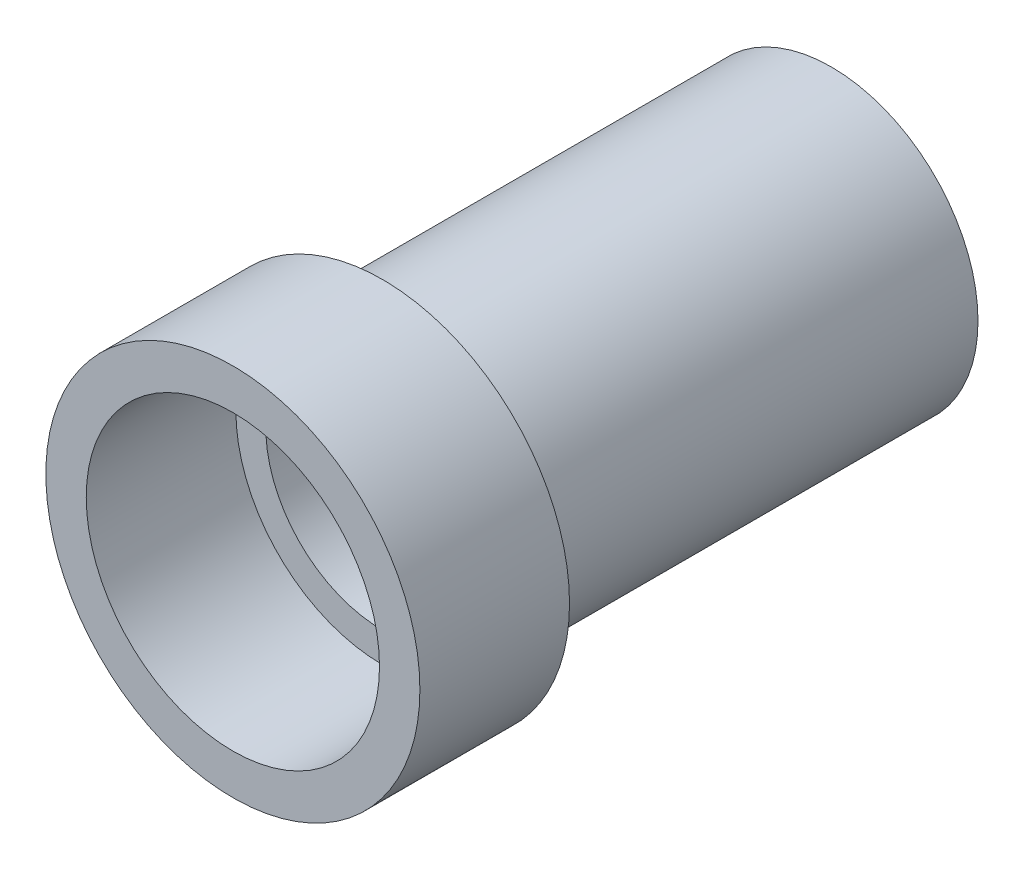
ISO-10303-21;
HEADER;
FILE_DESCRIPTION(('STEP AP214'),'2;1');
FILE_NAME('part.step','',(''),(''),'','','');
FILE_SCHEMA(('AUTOMOTIVE_DESIGN { 1 0 10303 214 1 1 1 1 }'));
ENDSEC;
DATA;
#1=APPLICATION_CONTEXT('core data for automotive mechanical design processes');
#2=APPLICATION_PROTOCOL_DEFINITION('international standard','automotive_design',2000,#1);
#3=PRODUCT_CONTEXT('',#1,'mechanical');
#4=PRODUCT('Part','Part','',(#3));
#5=PRODUCT_RELATED_PRODUCT_CATEGORY('part','',(#4));
#6=PRODUCT_DEFINITION_FORMATION('','',#4);
#7=PRODUCT_DEFINITION_CONTEXT('part definition',#1,'design');
#8=PRODUCT_DEFINITION('design','',#6,#7);
#9=PRODUCT_DEFINITION_SHAPE('','',#8);
#10=(LENGTH_UNIT() NAMED_UNIT(*) SI_UNIT(.MILLI.,.METRE.));
#11=(NAMED_UNIT(*) PLANE_ANGLE_UNIT() SI_UNIT($,.RADIAN.));
#12=(NAMED_UNIT(*) SI_UNIT($,.STERADIAN.) SOLID_ANGLE_UNIT());
#13=UNCERTAINTY_MEASURE_WITH_UNIT(LENGTH_MEASURE(1.E-05),#10,'distance_accuracy_value','');
#14=(GEOMETRIC_REPRESENTATION_CONTEXT(3) GLOBAL_UNCERTAINTY_ASSIGNED_CONTEXT((#13)) GLOBAL_UNIT_ASSIGNED_CONTEXT((#10,
#11,#12)) REPRESENTATION_CONTEXT('',''));
#15=CARTESIAN_POINT('',(0.,0.,0.));
#16=DIRECTION('',(0.,0.,1.));
#17=DIRECTION('',(1.,0.,0.));
#18=AXIS2_PLACEMENT_3D('',#15,#16,#17);
#19=CARTESIAN_POINT('',(0.,142.24,12.7));
#20=DIRECTION('',(0.,0.,1.));
#21=DIRECTION('',(1.,0.,0.));
#22=AXIS2_PLACEMENT_3D('',#19,#20,#21);
#23=PLANE('',#22);
#24=CARTESIAN_POINT('',(0.,142.24,12.7));
#25=DIRECTION('',(0.,0.,1.));
#26=DIRECTION('',(1.,0.,0.));
#27=AXIS2_PLACEMENT_3D('',#24,#25,#26);
#28=CIRCLE('',#27,15.875);
#29=CARTESIAN_POINT('',(15.875,142.24,12.7));
#30=VERTEX_POINT('',#29);
#31=EDGE_CURVE('E12',#30,#30,#28,.T.);
#32=ORIENTED_EDGE('',*,*,#31,.T.);
#33=EDGE_LOOP('',(#32));
#34=FACE_BOUND('',#33,.T.);
#35=CARTESIAN_POINT('',(0.,142.24,12.7));
#36=DIRECTION('',(0.,0.,1.));
#37=DIRECTION('',(1.,0.,0.));
#38=AXIS2_PLACEMENT_3D('',#35,#36,#37);
#39=CIRCLE('',#38,12.446);
#40=CARTESIAN_POINT('',(12.446,142.24,12.7));
#41=VERTEX_POINT('',#40);
#42=EDGE_CURVE('E55',#41,#41,#39,.T.);
#43=ORIENTED_EDGE('',*,*,#42,.F.);
#44=EDGE_LOOP('',(#43));
#45=FACE_BOUND('',#44,.T.);
#46=ADVANCED_FACE('F44',(#34,#45),#23,.T.);
#47=CARTESIAN_POINT('',(0.,142.24,0.));
#48=DIRECTION('',(0.,0.,1.));
#49=DIRECTION('',(1.,0.,0.));
#50=AXIS2_PLACEMENT_3D('',#47,#48,#49);
#51=PLANE('',#50);
#52=CARTESIAN_POINT('',(0.,142.24,0.));
#53=DIRECTION('',(0.,0.,1.));
#54=DIRECTION('',(1.,0.,0.));
#55=AXIS2_PLACEMENT_3D('',#52,#53,#54);
#56=CIRCLE('',#55,15.875);
#57=CARTESIAN_POINT('',(15.875,142.24,0.));
#58=VERTEX_POINT('',#57);
#59=EDGE_CURVE('E48',#58,#58,#56,.T.);
#60=ORIENTED_EDGE('',*,*,#59,.F.);
#61=EDGE_LOOP('',(#60));
#62=FACE_BOUND('',#61,.T.);
#63=CARTESIAN_POINT('',(0.,142.24,0.));
#64=DIRECTION('',(0.,0.,1.));
#65=DIRECTION('',(1.,0.,0.));
#66=AXIS2_PLACEMENT_3D('',#63,#64,#65);
#67=CIRCLE('',#66,12.446);
#68=CARTESIAN_POINT('',(12.446,142.24,0.));
#69=VERTEX_POINT('',#68);
#70=EDGE_CURVE('E57',#69,#69,#67,.T.);
#71=ORIENTED_EDGE('',*,*,#70,.T.);
#72=EDGE_LOOP('',(#71));
#73=FACE_BOUND('',#72,.T.);
#74=ADVANCED_FACE('F67',(#62,#73),#51,.F.);
#75=CARTESIAN_POINT('',(0.,142.24,12.7));
#76=DIRECTION('',(0.,0.,-1.));
#77=DIRECTION('',(-1.,0.,0.));
#78=AXIS2_PLACEMENT_3D('',#75,#76,#77);
#79=CYLINDRICAL_SURFACE('',#78,15.875);
#80=ORIENTED_EDGE('',*,*,#31,.F.);
#81=EDGE_LOOP('',(#80));
#82=FACE_BOUND('',#81,.T.);
#83=ORIENTED_EDGE('',*,*,#59,.T.);
#84=EDGE_LOOP('',(#83));
#85=FACE_BOUND('',#84,.T.);
#86=ADVANCED_FACE('F46',(#82,#85),#79,.T.);
#87=CARTESIAN_POINT('',(0.,142.24,12.7));
#88=DIRECTION('',(0.,0.,-1.));
#89=DIRECTION('',(-1.,0.,0.));
#90=AXIS2_PLACEMENT_3D('',#87,#88,#89);
#91=CYLINDRICAL_SURFACE('',#90,12.446);
#92=ORIENTED_EDGE('',*,*,#42,.T.);
#93=EDGE_LOOP('',(#92));
#94=FACE_BOUND('',#93,.T.);
#95=ORIENTED_EDGE('',*,*,#70,.F.);
#96=EDGE_LOOP('',(#95));
#97=FACE_BOUND('',#96,.T.);
#98=ADVANCED_FACE('F63',(#94,#97),#91,.F.);
#99=CLOSED_SHELL('',(#46,#74,#86,#98));
#100=MANIFOLD_SOLID_BREP('B2',#99);
#101=CARTESIAN_POINT('',(0.,142.24,-38.1));
#102=DIRECTION('',(0.,0.,1.));
#103=DIRECTION('',(1.,0.,0.));
#104=AXIS2_PLACEMENT_3D('',#101,#102,#103);
#105=CYLINDRICAL_SURFACE('',#104,12.446);
#106=CARTESIAN_POINT('',(0.,142.24,-38.1));
#107=DIRECTION('',(0.,0.,1.));
#108=DIRECTION('',(1.,0.,0.));
#109=AXIS2_PLACEMENT_3D('',#106,#107,#108);
#110=CIRCLE('',#109,12.446);
#111=CARTESIAN_POINT('',(12.446,142.24,-38.1));
#112=VERTEX_POINT('',#111);
#113=EDGE_CURVE('E43',#112,#112,#110,.T.);
#114=ORIENTED_EDGE('',*,*,#113,.T.);
#115=EDGE_LOOP('',(#114));
#116=FACE_BOUND('',#115,.T.);
#117=CARTESIAN_POINT('',(0.,142.24,0.));
#118=DIRECTION('',(0.,0.,1.));
#119=DIRECTION('',(1.,0.,0.));
#120=AXIS2_PLACEMENT_3D('',#117,#118,#119);
#121=CIRCLE('',#120,12.446);
#122=CARTESIAN_POINT('',(12.446,142.24,0.));
#123=VERTEX_POINT('',#122);
#124=EDGE_CURVE('E108',#123,#123,#121,.T.);
#125=ORIENTED_EDGE('',*,*,#124,.F.);
#126=EDGE_LOOP('',(#125));
#127=FACE_BOUND('',#126,.T.);
#128=ADVANCED_FACE('F105',(#116,#127),#105,.T.);
#129=CARTESIAN_POINT('',(0.,142.24,-38.1));
#130=DIRECTION('',(0.,0.,1.));
#131=DIRECTION('',(1.,0.,0.));
#132=AXIS2_PLACEMENT_3D('',#129,#130,#131);
#133=PLANE('',#132);
#134=CARTESIAN_POINT('',(0.,142.24,-38.1));
#135=DIRECTION('',(0.,0.,1.));
#136=DIRECTION('',(1.,0.,0.));
#137=AXIS2_PLACEMENT_3D('',#134,#135,#136);
#138=CIRCLE('',#137,9.90599999999999);
#139=CARTESIAN_POINT('',(9.90599999999999,142.24,-38.1));
#140=VERTEX_POINT('',#139);
#141=EDGE_CURVE('E115',#140,#140,#138,.T.);
#142=ORIENTED_EDGE('',*,*,#141,.T.);
#143=EDGE_LOOP('',(#142));
#144=FACE_BOUND('',#143,.T.);
#145=ORIENTED_EDGE('',*,*,#113,.F.);
#146=EDGE_LOOP('',(#145));
#147=FACE_BOUND('',#146,.T.);
#148=ADVANCED_FACE('F123',(#144,#147),#133,.F.);
#149=CARTESIAN_POINT('',(0.,142.24,0.));
#150=DIRECTION('',(0.,0.,1.));
#151=DIRECTION('',(1.,0.,0.));
#152=AXIS2_PLACEMENT_3D('',#149,#150,#151);
#153=PLANE('',#152);
#154=CARTESIAN_POINT('',(0.,142.24,0.));
#155=DIRECTION('',(0.,0.,1.));
#156=DIRECTION('',(1.,0.,0.));
#157=AXIS2_PLACEMENT_3D('',#154,#155,#156);
#158=CIRCLE('',#157,9.90599999999999);
#159=CARTESIAN_POINT('',(9.90599999999999,142.24,0.));
#160=VERTEX_POINT('',#159);
#161=EDGE_CURVE('E117',#160,#160,#158,.T.);
#162=ORIENTED_EDGE('',*,*,#161,.F.);
#163=EDGE_LOOP('',(#162));
#164=FACE_BOUND('',#163,.T.);
#165=ORIENTED_EDGE('',*,*,#124,.T.);
#166=EDGE_LOOP('',(#165));
#167=FACE_BOUND('',#166,.T.);
#168=ADVANCED_FACE('F129',(#164,#167),#153,.T.);
#169=CARTESIAN_POINT('',(0.,142.24,-38.1));
#170=DIRECTION('',(0.,0.,1.));
#171=DIRECTION('',(1.,0.,0.));
#172=AXIS2_PLACEMENT_3D('',#169,#170,#171);
#173=CYLINDRICAL_SURFACE('',#172,9.90599999999999);
#174=ORIENTED_EDGE('',*,*,#141,.F.);
#175=EDGE_LOOP('',(#174));
#176=FACE_BOUND('',#175,.T.);
#177=ORIENTED_EDGE('',*,*,#161,.T.);
#178=EDGE_LOOP('',(#177));
#179=FACE_BOUND('',#178,.T.);
#180=ADVANCED_FACE('F126',(#176,#179),#173,.F.);
#181=CLOSED_SHELL('',(#128,#148,#168,#180));
#182=MANIFOLD_SOLID_BREP('B7',#181);
#183=ADVANCED_BREP_SHAPE_REPRESENTATION('',(#18,#100,#182),#14);
#184=SHAPE_DEFINITION_REPRESENTATION(#9,#183);
ENDSEC;
END-ISO-10303-21;
